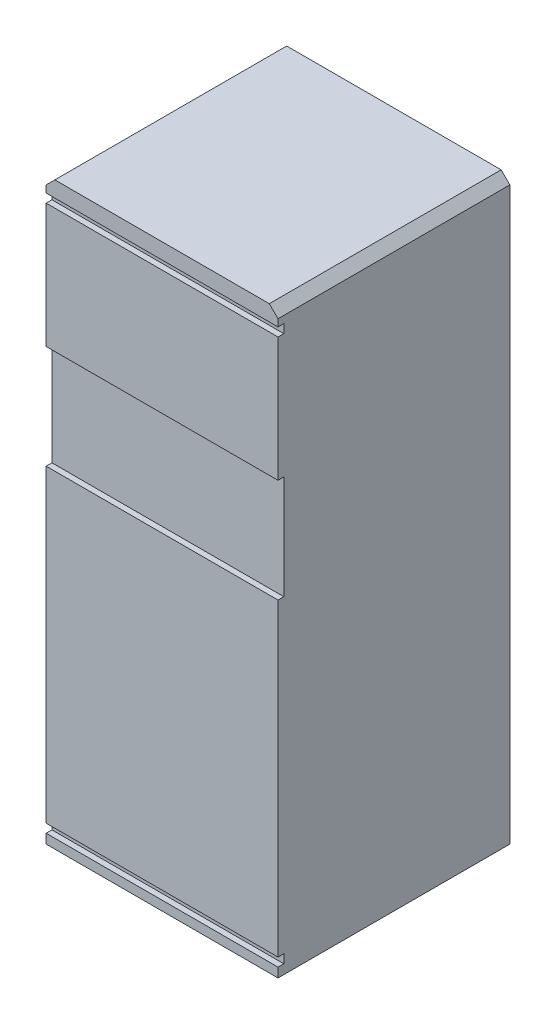
ISO-10303-21;
HEADER;
FILE_DESCRIPTION(('STEP AP214'),'2;1');
FILE_NAME('part.step','',(''),(''),'','','');
FILE_SCHEMA(('AUTOMOTIVE_DESIGN { 1 0 10303 214 1 1 1 1 }'));
ENDSEC;
DATA;
#1=APPLICATION_CONTEXT('core data for automotive mechanical design processes');
#2=APPLICATION_PROTOCOL_DEFINITION('international standard','automotive_design',2000,#1);
#3=PRODUCT_CONTEXT('',#1,'mechanical');
#4=PRODUCT('Part','Part','',(#3));
#5=PRODUCT_RELATED_PRODUCT_CATEGORY('part','',(#4));
#6=PRODUCT_DEFINITION_FORMATION('','',#4);
#7=PRODUCT_DEFINITION_CONTEXT('part definition',#1,'design');
#8=PRODUCT_DEFINITION('design','',#6,#7);
#9=PRODUCT_DEFINITION_SHAPE('','',#8);
#10=(LENGTH_UNIT() NAMED_UNIT(*) SI_UNIT(.MILLI.,.METRE.));
#11=(NAMED_UNIT(*) PLANE_ANGLE_UNIT() SI_UNIT($,.RADIAN.));
#12=(NAMED_UNIT(*) SI_UNIT($,.STERADIAN.) SOLID_ANGLE_UNIT());
#13=UNCERTAINTY_MEASURE_WITH_UNIT(LENGTH_MEASURE(1.E-05),#10,'distance_accuracy_value','');
#14=(GEOMETRIC_REPRESENTATION_CONTEXT(3) GLOBAL_UNCERTAINTY_ASSIGNED_CONTEXT((#13)) GLOBAL_UNIT_ASSIGNED_CONTEXT((#10,
#11,#12)) REPRESENTATION_CONTEXT('',''));
#15=CARTESIAN_POINT('',(0.,0.,0.));
#16=DIRECTION('',(0.,0.,1.));
#17=DIRECTION('',(1.,0.,0.));
#18=AXIS2_PLACEMENT_3D('',#15,#16,#17);
#19=CARTESIAN_POINT('',(400.,2000.,-400.));
#20=DIRECTION('',(-1.,0.,0.));
#21=DIRECTION('',(0.,0.,1.));
#22=AXIS2_PLACEMENT_3D('',#19,#20,#21);
#23=PLANE('',#22);
#24=DIRECTION('',(0.,-1.,0.));
#25=VECTOR('',#24,1.);
#26=CARTESIAN_POINT('',(400.,2000.,-400.));
#27=LINE('',#26,#25);
#28=CARTESIAN_POINT('',(400.,1970.,-400.));
#29=VERTEX_POINT('',#28);
#30=CARTESIAN_POINT('',(400.,0.,-400.));
#31=VERTEX_POINT('',#30);
#32=EDGE_CURVE('E172',#29,#31,#27,.T.);
#33=ORIENTED_EDGE('',*,*,#32,.F.);
#34=DIRECTION('',(0.,0.,1.));
#35=VECTOR('',#34,1.);
#36=CARTESIAN_POINT('',(400.,1970.,400.));
#37=LINE('',#36,#35);
#38=CARTESIAN_POINT('',(400.,1970.,400.));
#39=VERTEX_POINT('',#38);
#40=EDGE_CURVE('E11',#29,#39,#37,.T.);
#41=ORIENTED_EDGE('',*,*,#40,.T.);
#42=DIRECTION('',(0.,-1.,0.));
#43=VECTOR('',#42,1.);
#44=CARTESIAN_POINT('',(400.,2000.,400.));
#45=LINE('',#44,#43);
#46=CARTESIAN_POINT('',(400.,1945.51273196442,400.));
#47=VERTEX_POINT('',#46);
#48=EDGE_CURVE('E193',#39,#47,#45,.T.);
#49=ORIENTED_EDGE('',*,*,#48,.T.);
#50=DIRECTION('',(0.,0.,-1.));
#51=VECTOR('',#50,1.);
#52=CARTESIAN_POINT('',(400.,1945.51273196442,-400.));
#53=LINE('',#52,#51);
#54=CARTESIAN_POINT('',(400.,1945.51273196442,380.));
#55=VERTEX_POINT('',#54);
#56=EDGE_CURVE('E247',#47,#55,#53,.T.);
#57=ORIENTED_EDGE('',*,*,#56,.T.);
#58=DIRECTION('',(0.,1.,0.));
#59=VECTOR('',#58,1.);
#60=CARTESIAN_POINT('',(400.,2000.,380.));
#61=LINE('',#60,#59);
#62=CARTESIAN_POINT('',(400.,1915.51273196442,380.));
#63=VERTEX_POINT('',#62);
#64=EDGE_CURVE('E251',#63,#55,#61,.T.);
#65=ORIENTED_EDGE('',*,*,#64,.F.);
#66=DIRECTION('',(0.,0.,-1.));
#67=VECTOR('',#66,1.);
#68=CARTESIAN_POINT('',(400.,1915.51273196442,-400.));
#69=LINE('',#68,#67);
#70=CARTESIAN_POINT('',(400.,1915.51273196442,400.));
#71=VERTEX_POINT('',#70);
#72=EDGE_CURVE('E292',#71,#63,#69,.T.);
#73=ORIENTED_EDGE('',*,*,#72,.F.);
#74=CARTESIAN_POINT('',(400.,1487.15617354025,400.));
#75=VERTEX_POINT('',#74);
#76=EDGE_CURVE('E286',#71,#75,#45,.T.);
#77=ORIENTED_EDGE('',*,*,#76,.T.);
#78=DIRECTION('',(0.,0.,1.));
#79=VECTOR('',#78,1.);
#80=CARTESIAN_POINT('',(400.,1487.15617354025,-400.));
#81=LINE('',#80,#79);
#82=CARTESIAN_POINT('',(400.,1487.15617354025,380.));
#83=VERTEX_POINT('',#82);
#84=EDGE_CURVE('E166',#83,#75,#81,.T.);
#85=ORIENTED_EDGE('',*,*,#84,.F.);
#86=CARTESIAN_POINT('',(400.,1129.44844519169,380.));
#87=VERTEX_POINT('',#86);
#88=EDGE_CURVE('E258',#87,#83,#61,.T.);
#89=ORIENTED_EDGE('',*,*,#88,.F.);
#90=DIRECTION('',(0.,0.,-1.));
#91=VECTOR('',#90,1.);
#92=CARTESIAN_POINT('',(400.,1129.44844519169,-400.));
#93=LINE('',#92,#91);
#94=CARTESIAN_POINT('',(400.,1129.44844519169,400.));
#95=VERTEX_POINT('',#94);
#96=EDGE_CURVE('E307',#95,#87,#93,.T.);
#97=ORIENTED_EDGE('',*,*,#96,.F.);
#98=CARTESIAN_POINT('',(400.,62.6025015344469,400.));
#99=VERTEX_POINT('',#98);
#100=EDGE_CURVE('E284',#95,#99,#45,.T.);
#101=ORIENTED_EDGE('',*,*,#100,.T.);
#102=DIRECTION('',(0.,0.,1.));
#103=VECTOR('',#102,1.);
#104=CARTESIAN_POINT('',(400.,62.6025015344469,-400.));
#105=LINE('',#104,#103);
#106=CARTESIAN_POINT('',(400.,62.6025015344469,380.));
#107=VERTEX_POINT('',#106);
#108=EDGE_CURVE('E299',#107,#99,#105,.T.);
#109=ORIENTED_EDGE('',*,*,#108,.F.);
#110=CARTESIAN_POINT('',(400.,32.6025015344469,380.));
#111=VERTEX_POINT('',#110);
#112=EDGE_CURVE('E259',#111,#107,#61,.T.);
#113=ORIENTED_EDGE('',*,*,#112,.F.);
#114=DIRECTION('',(0.,0.,1.));
#115=VECTOR('',#114,1.);
#116=CARTESIAN_POINT('',(400.,32.6025015344469,-400.));
#117=LINE('',#116,#115);
#118=CARTESIAN_POINT('',(400.,32.6025015344469,400.));
#119=VERTEX_POINT('',#118);
#120=EDGE_CURVE('E248',#111,#119,#117,.T.);
#121=ORIENTED_EDGE('',*,*,#120,.T.);
#122=CARTESIAN_POINT('',(400.,0.,400.));
#123=VERTEX_POINT('',#122);
#124=EDGE_CURVE('E262',#119,#123,#45,.T.);
#125=ORIENTED_EDGE('',*,*,#124,.T.);
#126=DIRECTION('',(0.,0.,-1.));
#127=VECTOR('',#126,1.);
#128=CARTESIAN_POINT('',(400.,0.,-400.));
#129=LINE('',#128,#127);
#130=EDGE_CURVE('E263',#123,#31,#129,.T.);
#131=ORIENTED_EDGE('',*,*,#130,.T.);
#132=EDGE_LOOP('',(#33,#41,#49,#57,#65,#73,#77,#85,#89,#97,#101,#109,#113,#121,#125,#131));
#133=FACE_BOUND('',#132,.T.);
#134=ADVANCED_FACE('F35',(#133),#23,.F.);
#135=CARTESIAN_POINT('',(-400.,2000.,-400.));
#136=DIRECTION('',(1.,0.,0.));
#137=DIRECTION('',(0.,0.,-1.));
#138=AXIS2_PLACEMENT_3D('',#135,#136,#137);
#139=PLANE('',#138);
#140=DIRECTION('',(0.,-1.,0.));
#141=VECTOR('',#140,1.);
#142=CARTESIAN_POINT('',(-400.,2000.,400.));
#143=LINE('',#142,#141);
#144=CARTESIAN_POINT('',(-400.,1970.,400.));
#145=VERTEX_POINT('',#144);
#146=CARTESIAN_POINT('',(-400.,1945.51273196442,400.));
#147=VERTEX_POINT('',#146);
#148=EDGE_CURVE('E185',#145,#147,#143,.T.);
#149=ORIENTED_EDGE('',*,*,#148,.F.);
#150=DIRECTION('',(0.,0.,-1.));
#151=VECTOR('',#150,1.);
#152=CARTESIAN_POINT('',(-400.,1970.,-400.));
#153=LINE('',#152,#151);
#154=CARTESIAN_POINT('',(-400.,1970.,-400.));
#155=VERTEX_POINT('',#154);
#156=EDGE_CURVE('E58',#145,#155,#153,.T.);
#157=ORIENTED_EDGE('',*,*,#156,.T.);
#158=DIRECTION('',(0.,-1.,0.));
#159=VECTOR('',#158,1.);
#160=CARTESIAN_POINT('',(-400.,2000.,-400.));
#161=LINE('',#160,#159);
#162=CARTESIAN_POINT('',(-400.,0.,-400.));
#163=VERTEX_POINT('',#162);
#164=EDGE_CURVE('E188',#155,#163,#161,.T.);
#165=ORIENTED_EDGE('',*,*,#164,.T.);
#166=DIRECTION('',(0.,0.,1.));
#167=VECTOR('',#166,1.);
#168=CARTESIAN_POINT('',(-400.,0.,-400.));
#169=LINE('',#168,#167);
#170=CARTESIAN_POINT('',(-400.,0.,400.));
#171=VERTEX_POINT('',#170);
#172=EDGE_CURVE('E268',#163,#171,#169,.T.);
#173=ORIENTED_EDGE('',*,*,#172,.T.);
#174=CARTESIAN_POINT('',(-400.,32.6025015344468,400.));
#175=VERTEX_POINT('',#174);
#176=EDGE_CURVE('E189',#175,#171,#143,.T.);
#177=ORIENTED_EDGE('',*,*,#176,.F.);
#178=DIRECTION('',(0.,0.,-1.));
#179=VECTOR('',#178,1.);
#180=CARTESIAN_POINT('',(-400.,32.6025015344469,-400.));
#181=LINE('',#180,#179);
#182=CARTESIAN_POINT('',(-400.,32.6025015344468,380.));
#183=VERTEX_POINT('',#182);
#184=EDGE_CURVE('E254',#175,#183,#181,.T.);
#185=ORIENTED_EDGE('',*,*,#184,.T.);
#186=DIRECTION('',(0.,-1.,0.));
#187=VECTOR('',#186,1.);
#188=CARTESIAN_POINT('',(-400.,2000.,380.));
#189=LINE('',#188,#187);
#190=CARTESIAN_POINT('',(-400.,62.6025015344469,380.));
#191=VERTEX_POINT('',#190);
#192=EDGE_CURVE('E210',#191,#183,#189,.T.);
#193=ORIENTED_EDGE('',*,*,#192,.F.);
#194=DIRECTION('',(0.,0.,-1.));
#195=VECTOR('',#194,1.);
#196=CARTESIAN_POINT('',(-400.,62.6025015344469,-400.));
#197=LINE('',#196,#195);
#198=CARTESIAN_POINT('',(-400.,62.6025015344469,400.));
#199=VERTEX_POINT('',#198);
#200=EDGE_CURVE('E296',#199,#191,#197,.T.);
#201=ORIENTED_EDGE('',*,*,#200,.F.);
#202=CARTESIAN_POINT('',(-400.,1129.44844519169,400.));
#203=VERTEX_POINT('',#202);
#204=EDGE_CURVE('E186',#203,#199,#143,.T.);
#205=ORIENTED_EDGE('',*,*,#204,.F.);
#206=DIRECTION('',(0.,0.,1.));
#207=VECTOR('',#206,1.);
#208=CARTESIAN_POINT('',(-400.,1129.44844519169,-400.));
#209=LINE('',#208,#207);
#210=CARTESIAN_POINT('',(-400.,1129.44844519169,380.));
#211=VERTEX_POINT('',#210);
#212=EDGE_CURVE('E305',#211,#203,#209,.T.);
#213=ORIENTED_EDGE('',*,*,#212,.F.);
#214=CARTESIAN_POINT('',(-400.,1487.15617354025,380.));
#215=VERTEX_POINT('',#214);
#216=EDGE_CURVE('E180',#215,#211,#189,.T.);
#217=ORIENTED_EDGE('',*,*,#216,.F.);
#218=DIRECTION('',(0.,0.,-1.));
#219=VECTOR('',#218,1.);
#220=CARTESIAN_POINT('',(-400.,1487.15617354025,-400.));
#221=LINE('',#220,#219);
#222=CARTESIAN_POINT('',(-400.,1487.15617354025,400.));
#223=VERTEX_POINT('',#222);
#224=EDGE_CURVE('E163',#223,#215,#221,.T.);
#225=ORIENTED_EDGE('',*,*,#224,.F.);
#226=CARTESIAN_POINT('',(-400.,1915.51273196442,400.));
#227=VERTEX_POINT('',#226);
#228=EDGE_CURVE('E178',#227,#223,#143,.T.);
#229=ORIENTED_EDGE('',*,*,#228,.F.);
#230=DIRECTION('',(0.,0.,1.));
#231=VECTOR('',#230,1.);
#232=CARTESIAN_POINT('',(-400.,1915.51273196442,-400.));
#233=LINE('',#232,#231);
#234=CARTESIAN_POINT('',(-400.,1915.51273196442,380.));
#235=VERTEX_POINT('',#234);
#236=EDGE_CURVE('E297',#235,#227,#233,.T.);
#237=ORIENTED_EDGE('',*,*,#236,.F.);
#238=CARTESIAN_POINT('',(-400.,1945.51273196442,380.));
#239=VERTEX_POINT('',#238);
#240=EDGE_CURVE('E209',#239,#235,#189,.T.);
#241=ORIENTED_EDGE('',*,*,#240,.F.);
#242=DIRECTION('',(0.,0.,1.));
#243=VECTOR('',#242,1.);
#244=CARTESIAN_POINT('',(-400.,1945.51273196442,-400.));
#245=LINE('',#244,#243);
#246=EDGE_CURVE('E243',#239,#147,#245,.T.);
#247=ORIENTED_EDGE('',*,*,#246,.T.);
#248=EDGE_LOOP('',(#149,#157,#165,#173,#177,#185,#193,#201,#205,#213,#217,#225,#229,#237,#241,#247));
#249=FACE_BOUND('',#248,.T.);
#250=ADVANCED_FACE('F176',(#249),#139,.F.);
#251=CARTESIAN_POINT('',(-400.,2000.,400.));
#252=DIRECTION('',(0.,0.,-1.));
#253=DIRECTION('',(-1.,0.,0.));
#254=AXIS2_PLACEMENT_3D('',#251,#252,#253);
#255=PLANE('',#254);
#256=DIRECTION('',(1.,0.,0.));
#257=VECTOR('',#256,1.);
#258=CARTESIAN_POINT('',(-400.,1129.44844519169,400.));
#259=LINE('',#258,#257);
#260=EDGE_CURVE('E200',#203,#95,#259,.T.);
#261=ORIENTED_EDGE('',*,*,#260,.F.);
#262=ORIENTED_EDGE('',*,*,#204,.T.);
#263=DIRECTION('',(-1.,0.,0.));
#264=VECTOR('',#263,1.);
#265=CARTESIAN_POINT('',(-400.,62.6025015344469,400.));
#266=LINE('',#265,#264);
#267=EDGE_CURVE('E198',#99,#199,#266,.T.);
#268=ORIENTED_EDGE('',*,*,#267,.F.);
#269=ORIENTED_EDGE('',*,*,#100,.F.);
#270=EDGE_LOOP('',(#261,#262,#268,#269));
#271=FACE_BOUND('',#270,.T.);
#272=ADVANCED_FACE('F342',(#271),#255,.F.);
#273=DIRECTION('',(1.,0.,0.));
#274=VECTOR('',#273,1.);
#275=CARTESIAN_POINT('',(-400.,1915.51273196442,400.));
#276=LINE('',#275,#274);
#277=EDGE_CURVE('E171',#227,#71,#276,.T.);
#278=ORIENTED_EDGE('',*,*,#277,.F.);
#279=ORIENTED_EDGE('',*,*,#228,.T.);
#280=DIRECTION('',(-1.,0.,0.));
#281=VECTOR('',#280,1.);
#282=CARTESIAN_POINT('',(-400.,1487.15617354025,400.));
#283=LINE('',#282,#281);
#284=EDGE_CURVE('E159',#75,#223,#283,.T.);
#285=ORIENTED_EDGE('',*,*,#284,.F.);
#286=ORIENTED_EDGE('',*,*,#76,.F.);
#287=EDGE_LOOP('',(#278,#279,#285,#286));
#288=FACE_BOUND('',#287,.T.);
#289=ADVANCED_FACE('F184',(#288),#255,.F.);
#290=DIRECTION('',(1.,0.,0.));
#291=VECTOR('',#290,1.);
#292=CARTESIAN_POINT('',(-400.,2000.,400.));
#293=LINE('',#292,#291);
#294=CARTESIAN_POINT('',(-370.,2000.,400.));
#295=VERTEX_POINT('',#294);
#296=CARTESIAN_POINT('',(370.,2000.,400.));
#297=VERTEX_POINT('',#296);
#298=EDGE_CURVE('E234',#295,#297,#293,.T.);
#299=ORIENTED_EDGE('',*,*,#298,.F.);
#300=DIRECTION('',(-0.707106781186542,-0.707106781186553,0.));
#301=VECTOR('',#300,1.);
#302=CARTESIAN_POINT('',(-370.,2000.,400.));
#303=LINE('',#302,#301);
#304=EDGE_CURVE('E219',#295,#145,#303,.T.);
#305=ORIENTED_EDGE('',*,*,#304,.T.);
#306=ORIENTED_EDGE('',*,*,#148,.T.);
#307=DIRECTION('',(1.,0.,0.));
#308=VECTOR('',#307,1.);
#309=CARTESIAN_POINT('',(-400.,1945.51273196442,400.));
#310=LINE('',#309,#308);
#311=EDGE_CURVE('E205',#147,#47,#310,.T.);
#312=ORIENTED_EDGE('',*,*,#311,.T.);
#313=ORIENTED_EDGE('',*,*,#48,.F.);
#314=DIRECTION('',(-0.707106781186542,0.707106781186553,0.));
#315=VECTOR('',#314,1.);
#316=CARTESIAN_POINT('',(370.,2000.,400.));
#317=LINE('',#316,#315);
#318=EDGE_CURVE('E217',#39,#297,#317,.T.);
#319=ORIENTED_EDGE('',*,*,#318,.T.);
#320=EDGE_LOOP('',(#299,#305,#306,#312,#313,#319));
#321=FACE_BOUND('',#320,.T.);
#322=ADVANCED_FACE('F239',(#321),#255,.F.);
#323=CARTESIAN_POINT('',(-400.,2000.,-400.));
#324=DIRECTION('',(0.,0.,1.));
#325=DIRECTION('',(1.,0.,0.));
#326=AXIS2_PLACEMENT_3D('',#323,#324,#325);
#327=PLANE('',#326);
#328=ORIENTED_EDGE('',*,*,#164,.F.);
#329=DIRECTION('',(0.707106781186542,0.707106781186553,0.));
#330=VECTOR('',#329,1.);
#331=CARTESIAN_POINT('',(-370.000000000001,2000.,-400.));
#332=LINE('',#331,#330);
#333=CARTESIAN_POINT('',(-370.000000000001,2000.,-400.));
#334=VERTEX_POINT('',#333);
#335=EDGE_CURVE('E43',#155,#334,#332,.T.);
#336=ORIENTED_EDGE('',*,*,#335,.T.);
#337=DIRECTION('',(-1.,0.,0.));
#338=VECTOR('',#337,1.);
#339=CARTESIAN_POINT('',(-400.,2000.,-400.));
#340=LINE('',#339,#338);
#341=CARTESIAN_POINT('',(370.,2000.,-400.));
#342=VERTEX_POINT('',#341);
#343=EDGE_CURVE('E225',#342,#334,#340,.T.);
#344=ORIENTED_EDGE('',*,*,#343,.F.);
#345=DIRECTION('',(0.707106781186542,-0.707106781186553,0.));
#346=VECTOR('',#345,1.);
#347=CARTESIAN_POINT('',(370.,2000.,-400.));
#348=LINE('',#347,#346);
#349=EDGE_CURVE('E50',#342,#29,#348,.T.);
#350=ORIENTED_EDGE('',*,*,#349,.T.);
#351=ORIENTED_EDGE('',*,*,#32,.T.);
#352=DIRECTION('',(-1.,0.,0.));
#353=VECTOR('',#352,1.);
#354=CARTESIAN_POINT('',(-400.,0.,-400.));
#355=LINE('',#354,#353);
#356=EDGE_CURVE('E266',#31,#163,#355,.T.);
#357=ORIENTED_EDGE('',*,*,#356,.T.);
#358=EDGE_LOOP('',(#328,#336,#344,#350,#351,#357));
#359=FACE_BOUND('',#358,.T.);
#360=ADVANCED_FACE('F224',(#359),#327,.F.);
#361=ORIENTED_EDGE('',*,*,#124,.F.);
#362=DIRECTION('',(-1.,0.,0.));
#363=VECTOR('',#362,1.);
#364=CARTESIAN_POINT('',(-400.,32.6025015344469,400.));
#365=LINE('',#364,#363);
#366=EDGE_CURVE('E202',#119,#175,#365,.T.);
#367=ORIENTED_EDGE('',*,*,#366,.T.);
#368=ORIENTED_EDGE('',*,*,#176,.T.);
#369=DIRECTION('',(1.,0.,0.));
#370=VECTOR('',#369,1.);
#371=CARTESIAN_POINT('',(-400.,0.,400.));
#372=LINE('',#371,#370);
#373=EDGE_CURVE('E235',#171,#123,#372,.T.);
#374=ORIENTED_EDGE('',*,*,#373,.T.);
#375=EDGE_LOOP('',(#361,#367,#368,#374));
#376=FACE_BOUND('',#375,.T.);
#377=ADVANCED_FACE('F275',(#376),#255,.F.);
#378=CARTESIAN_POINT('',(0.,2000.,0.));
#379=DIRECTION('',(0.,1.,0.));
#380=DIRECTION('',(0.,0.,1.));
#381=AXIS2_PLACEMENT_3D('',#378,#379,#380);
#382=PLANE('',#381);
#383=ORIENTED_EDGE('',*,*,#343,.T.);
#384=DIRECTION('',(0.,0.,1.));
#385=VECTOR('',#384,1.);
#386=CARTESIAN_POINT('',(-370.,2000.,400.));
#387=LINE('',#386,#385);
#388=EDGE_CURVE('E214',#334,#295,#387,.T.);
#389=ORIENTED_EDGE('',*,*,#388,.T.);
#390=ORIENTED_EDGE('',*,*,#298,.T.);
#391=DIRECTION('',(0.,0.,-1.));
#392=VECTOR('',#391,1.);
#393=CARTESIAN_POINT('',(370.,2000.,-400.));
#394=LINE('',#393,#392);
#395=EDGE_CURVE('E211',#297,#342,#394,.T.);
#396=ORIENTED_EDGE('',*,*,#395,.T.);
#397=EDGE_LOOP('',(#383,#389,#390,#396));
#398=FACE_BOUND('',#397,.T.);
#399=ADVANCED_FACE('F230',(#398),#382,.T.);
#400=CARTESIAN_POINT('',(0.,0.,0.));
#401=DIRECTION('',(0.,1.,0.));
#402=DIRECTION('',(0.,0.,1.));
#403=AXIS2_PLACEMENT_3D('',#400,#401,#402);
#404=PLANE('',#403);
#405=ORIENTED_EDGE('',*,*,#130,.F.);
#406=ORIENTED_EDGE('',*,*,#373,.F.);
#407=ORIENTED_EDGE('',*,*,#172,.F.);
#408=ORIENTED_EDGE('',*,*,#356,.F.);
#409=EDGE_LOOP('',(#405,#406,#407,#408));
#410=FACE_BOUND('',#409,.T.);
#411=ADVANCED_FACE('F280',(#410),#404,.F.);
#412=CARTESIAN_POINT('',(446.238550510599,1487.15617354025,380.));
#413=DIRECTION('',(0.,-1.,0.));
#414=DIRECTION('',(0.,0.,-1.));
#415=AXIS2_PLACEMENT_3D('',#412,#413,#414);
#416=PLANE('',#415);
#417=ORIENTED_EDGE('',*,*,#84,.T.);
#418=ORIENTED_EDGE('',*,*,#284,.T.);
#419=ORIENTED_EDGE('',*,*,#224,.T.);
#420=DIRECTION('',(1.,0.,0.));
#421=VECTOR('',#420,1.);
#422=CARTESIAN_POINT('',(446.238550510599,1487.15617354025,380.));
#423=LINE('',#422,#421);
#424=EDGE_CURVE('E328',#215,#83,#423,.T.);
#425=ORIENTED_EDGE('',*,*,#424,.T.);
#426=EDGE_LOOP('',(#417,#418,#419,#425));
#427=FACE_BOUND('',#426,.T.);
#428=ADVANCED_FACE('F161',(#427),#416,.T.);
#429=CARTESIAN_POINT('',(-423.105485688733,1129.44844519169,380.));
#430=DIRECTION('',(0.,1.,0.));
#431=DIRECTION('',(0.,0.,1.));
#432=AXIS2_PLACEMENT_3D('',#429,#430,#431);
#433=PLANE('',#432);
#434=ORIENTED_EDGE('',*,*,#96,.T.);
#435=DIRECTION('',(-1.,0.,0.));
#436=VECTOR('',#435,1.);
#437=CARTESIAN_POINT('',(-423.105485688733,1129.44844519169,380.));
#438=LINE('',#437,#436);
#439=EDGE_CURVE('E317',#87,#211,#438,.T.);
#440=ORIENTED_EDGE('',*,*,#439,.T.);
#441=ORIENTED_EDGE('',*,*,#212,.T.);
#442=ORIENTED_EDGE('',*,*,#260,.T.);
#443=EDGE_LOOP('',(#434,#440,#441,#442));
#444=FACE_BOUND('',#443,.T.);
#445=ADVANCED_FACE('F345',(#444),#433,.T.);
#446=CARTESIAN_POINT('',(-403.105485688733,1895.51273196442,380.));
#447=DIRECTION('',(0.,0.,1.));
#448=DIRECTION('',(1.,0.,0.));
#449=AXIS2_PLACEMENT_3D('',#446,#447,#448);
#450=PLANE('',#449);
#451=ORIENTED_EDGE('',*,*,#88,.T.);
#452=ORIENTED_EDGE('',*,*,#424,.F.);
#453=ORIENTED_EDGE('',*,*,#216,.T.);
#454=ORIENTED_EDGE('',*,*,#439,.F.);
#455=EDGE_LOOP('',(#451,#452,#453,#454));
#456=FACE_BOUND('',#455,.T.);
#457=ADVANCED_FACE('F330',(#456),#450,.T.);
#458=CARTESIAN_POINT('',(-403.105485688733,1945.51273196442,380.));
#459=DIRECTION('',(0.,1.,0.));
#460=DIRECTION('',(0.,0.,1.));
#461=AXIS2_PLACEMENT_3D('',#458,#459,#460);
#462=PLANE('',#461);
#463=ORIENTED_EDGE('',*,*,#311,.F.);
#464=ORIENTED_EDGE('',*,*,#246,.F.);
#465=DIRECTION('',(-1.,0.,0.));
#466=VECTOR('',#465,1.);
#467=CARTESIAN_POINT('',(-403.105485688733,1945.51273196442,380.));
#468=LINE('',#467,#466);
#469=EDGE_CURVE('E181',#55,#239,#468,.T.);
#470=ORIENTED_EDGE('',*,*,#469,.F.);
#471=ORIENTED_EDGE('',*,*,#56,.F.);
#472=EDGE_LOOP('',(#463,#464,#470,#471));
#473=FACE_BOUND('',#472,.T.);
#474=ADVANCED_FACE('F352',(#473),#462,.F.);
#475=CARTESIAN_POINT('',(-403.105485688733,1915.51273196442,380.));
#476=DIRECTION('',(0.,1.,0.));
#477=DIRECTION('',(0.,0.,1.));
#478=AXIS2_PLACEMENT_3D('',#475,#476,#477);
#479=PLANE('',#478);
#480=ORIENTED_EDGE('',*,*,#72,.T.);
#481=DIRECTION('',(-1.,0.,0.));
#482=VECTOR('',#481,1.);
#483=CARTESIAN_POINT('',(-403.105485688733,1915.51273196442,380.));
#484=LINE('',#483,#482);
#485=EDGE_CURVE('E326',#63,#235,#484,.T.);
#486=ORIENTED_EDGE('',*,*,#485,.T.);
#487=ORIENTED_EDGE('',*,*,#236,.T.);
#488=ORIENTED_EDGE('',*,*,#277,.T.);
#489=EDGE_LOOP('',(#480,#486,#487,#488));
#490=FACE_BOUND('',#489,.T.);
#491=ADVANCED_FACE('F377',(#490),#479,.T.);
#492=ORIENTED_EDGE('',*,*,#64,.T.);
#493=ORIENTED_EDGE('',*,*,#469,.T.);
#494=ORIENTED_EDGE('',*,*,#240,.T.);
#495=ORIENTED_EDGE('',*,*,#485,.F.);
#496=EDGE_LOOP('',(#492,#493,#494,#495));
#497=FACE_BOUND('',#496,.T.);
#498=ADVANCED_FACE('F354',(#497),#450,.T.);
#499=ORIENTED_EDGE('',*,*,#112,.T.);
#500=DIRECTION('',(1.,0.,0.));
#501=VECTOR('',#500,1.);
#502=CARTESIAN_POINT('',(-403.105485688733,62.6025015344469,380.));
#503=LINE('',#502,#501);
#504=EDGE_CURVE('E321',#191,#107,#503,.T.);
#505=ORIENTED_EDGE('',*,*,#504,.F.);
#506=ORIENTED_EDGE('',*,*,#192,.T.);
#507=DIRECTION('',(1.,0.,0.));
#508=VECTOR('',#507,1.);
#509=CARTESIAN_POINT('',(-403.105485688733,32.6025015344468,380.));
#510=LINE('',#509,#508);
#511=EDGE_CURVE('E315',#183,#111,#510,.T.);
#512=ORIENTED_EDGE('',*,*,#511,.T.);
#513=EDGE_LOOP('',(#499,#505,#506,#512));
#514=FACE_BOUND('',#513,.T.);
#515=ADVANCED_FACE('F334',(#514),#450,.T.);
#516=CARTESIAN_POINT('',(-403.105485688733,32.6025015344468,380.));
#517=DIRECTION('',(0.,-1.,0.));
#518=DIRECTION('',(1.,0.,0.));
#519=AXIS2_PLACEMENT_3D('',#516,#517,#518);
#520=PLANE('',#519);
#521=ORIENTED_EDGE('',*,*,#511,.F.);
#522=ORIENTED_EDGE('',*,*,#184,.F.);
#523=ORIENTED_EDGE('',*,*,#366,.F.);
#524=ORIENTED_EDGE('',*,*,#120,.F.);
#525=EDGE_LOOP('',(#521,#522,#523,#524));
#526=FACE_BOUND('',#525,.T.);
#527=ADVANCED_FACE('F313',(#526),#520,.F.);
#528=CARTESIAN_POINT('',(-403.105485688733,62.6025015344469,380.));
#529=DIRECTION('',(0.,-1.,0.));
#530=DIRECTION('',(1.,0.,0.));
#531=AXIS2_PLACEMENT_3D('',#528,#529,#530);
#532=PLANE('',#531);
#533=ORIENTED_EDGE('',*,*,#108,.T.);
#534=ORIENTED_EDGE('',*,*,#267,.T.);
#535=ORIENTED_EDGE('',*,*,#200,.T.);
#536=ORIENTED_EDGE('',*,*,#504,.T.);
#537=EDGE_LOOP('',(#533,#534,#535,#536));
#538=FACE_BOUND('',#537,.T.);
#539=ADVANCED_FACE('F337',(#538),#532,.T.);
#540=CARTESIAN_POINT('',(-370.000000000001,2000.,0.));
#541=DIRECTION('',(-0.707106781186553,0.707106781186542,0.));
#542=DIRECTION('',(0.,0.,-1.));
#543=AXIS2_PLACEMENT_3D('',#540,#541,#542);
#544=PLANE('',#543);
#545=ORIENTED_EDGE('',*,*,#335,.F.);
#546=ORIENTED_EDGE('',*,*,#156,.F.);
#547=ORIENTED_EDGE('',*,*,#304,.F.);
#548=ORIENTED_EDGE('',*,*,#388,.F.);
#549=EDGE_LOOP('',(#545,#546,#547,#548));
#550=FACE_BOUND('',#549,.T.);
#551=ADVANCED_FACE('F237',(#550),#544,.T.);
#552=CARTESIAN_POINT('',(370.,2000.,0.));
#553=DIRECTION('',(0.707106781186553,0.707106781186542,0.));
#554=DIRECTION('',(0.,0.,1.));
#555=AXIS2_PLACEMENT_3D('',#552,#553,#554);
#556=PLANE('',#555);
#557=ORIENTED_EDGE('',*,*,#318,.F.);
#558=ORIENTED_EDGE('',*,*,#40,.F.);
#559=ORIENTED_EDGE('',*,*,#349,.F.);
#560=ORIENTED_EDGE('',*,*,#395,.F.);
#561=EDGE_LOOP('',(#557,#558,#559,#560));
#562=FACE_BOUND('',#561,.T.);
#563=ADVANCED_FACE('F37',(#562),#556,.T.);
#564=CLOSED_SHELL('',(#134,#250,#272,#289,#322,#360,#377,#399,#411,#428,#445,#457,#474,#491,
#498,#515,#527,#539,#551,#563));
#565=MANIFOLD_SOLID_BREP('B2',#564);
#566=ADVANCED_BREP_SHAPE_REPRESENTATION('',(#18,#565),#14);
#567=SHAPE_DEFINITION_REPRESENTATION(#9,#566);
ENDSEC;
END-ISO-10303-21;
